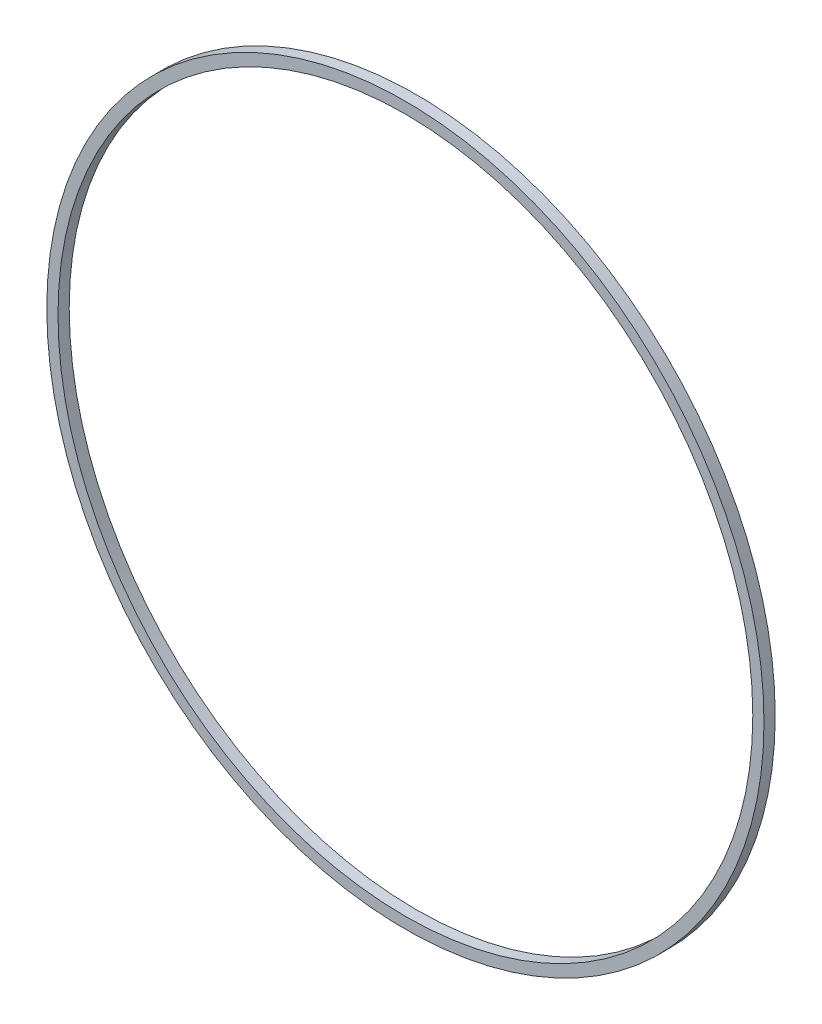
ISO-10303-21;
HEADER;
FILE_DESCRIPTION(('STEP AP214'),'2;1');
FILE_NAME('part.step','',(''),(''),'','','');
FILE_SCHEMA(('AUTOMOTIVE_DESIGN { 1 0 10303 214 1 1 1 1 }'));
ENDSEC;
DATA;
#1=APPLICATION_CONTEXT('core data for automotive mechanical design processes');
#2=APPLICATION_PROTOCOL_DEFINITION('international standard','automotive_design',2000,#1);
#3=PRODUCT_CONTEXT('',#1,'mechanical');
#4=PRODUCT('Part','Part','',(#3));
#5=PRODUCT_RELATED_PRODUCT_CATEGORY('part','',(#4));
#6=PRODUCT_DEFINITION_FORMATION('','',#4);
#7=PRODUCT_DEFINITION_CONTEXT('part definition',#1,'design');
#8=PRODUCT_DEFINITION('design','',#6,#7);
#9=PRODUCT_DEFINITION_SHAPE('','',#8);
#10=(LENGTH_UNIT() NAMED_UNIT(*) SI_UNIT(.MILLI.,.METRE.));
#11=(NAMED_UNIT(*) PLANE_ANGLE_UNIT() SI_UNIT($,.RADIAN.));
#12=(NAMED_UNIT(*) SI_UNIT($,.STERADIAN.) SOLID_ANGLE_UNIT());
#13=UNCERTAINTY_MEASURE_WITH_UNIT(LENGTH_MEASURE(1.E-05),#10,'distance_accuracy_value','');
#14=(GEOMETRIC_REPRESENTATION_CONTEXT(3) GLOBAL_UNCERTAINTY_ASSIGNED_CONTEXT((#13)) GLOBAL_UNIT_ASSIGNED_CONTEXT((#10,
#11,#12)) REPRESENTATION_CONTEXT('',''));
#15=CARTESIAN_POINT('',(0.,0.,0.));
#16=DIRECTION('',(0.,0.,1.));
#17=DIRECTION('',(1.,0.,0.));
#18=AXIS2_PLACEMENT_3D('',#15,#16,#17);
#19=CARTESIAN_POINT('',(0.,0.,0.5));
#20=DIRECTION('',(0.,0.,1.));
#21=DIRECTION('',(1.,0.,0.));
#22=AXIS2_PLACEMENT_3D('',#19,#20,#21);
#23=PLANE('',#22);
#24=CARTESIAN_POINT('',(0.,0.,0.5));
#25=DIRECTION('',(0.,0.,1.));
#26=DIRECTION('',(1.,0.,0.));
#27=AXIS2_PLACEMENT_3D('',#24,#25,#26);
#28=CIRCLE('',#27,16.);
#29=CARTESIAN_POINT('',(16.,0.,0.5));
#30=VERTEX_POINT('',#29);
#31=EDGE_CURVE('E10',#30,#30,#28,.T.);
#32=ORIENTED_EDGE('',*,*,#31,.T.);
#33=EDGE_LOOP('',(#32));
#34=FACE_BOUND('',#33,.T.);
#35=CARTESIAN_POINT('',(0.,0.,0.5));
#36=DIRECTION('',(0.,0.,1.));
#37=DIRECTION('',(1.,0.,0.));
#38=AXIS2_PLACEMENT_3D('',#35,#36,#37);
#39=CIRCLE('',#38,15.5);
#40=CARTESIAN_POINT('',(15.5,0.,0.5));
#41=VERTEX_POINT('',#40);
#42=EDGE_CURVE('E50',#41,#41,#39,.T.);
#43=ORIENTED_EDGE('',*,*,#42,.F.);
#44=EDGE_LOOP('',(#43));
#45=FACE_BOUND('',#44,.T.);
#46=ADVANCED_FACE('F37',(#34,#45),#23,.T.);
#47=CARTESIAN_POINT('',(0.,0.,0.));
#48=DIRECTION('',(0.,0.,1.));
#49=DIRECTION('',(1.,0.,0.));
#50=AXIS2_PLACEMENT_3D('',#47,#48,#49);
#51=PLANE('',#50);
#52=CARTESIAN_POINT('',(0.,0.,0.));
#53=DIRECTION('',(0.,0.,1.));
#54=DIRECTION('',(1.,0.,0.));
#55=AXIS2_PLACEMENT_3D('',#52,#53,#54);
#56=CIRCLE('',#55,16.);
#57=CARTESIAN_POINT('',(16.,0.,0.));
#58=VERTEX_POINT('',#57);
#59=EDGE_CURVE('E41',#58,#58,#56,.T.);
#60=ORIENTED_EDGE('',*,*,#59,.F.);
#61=EDGE_LOOP('',(#60));
#62=FACE_BOUND('',#61,.T.);
#63=CARTESIAN_POINT('',(0.,0.,0.));
#64=DIRECTION('',(0.,0.,1.));
#65=DIRECTION('',(1.,0.,0.));
#66=AXIS2_PLACEMENT_3D('',#63,#64,#65);
#67=CIRCLE('',#66,15.5);
#68=CARTESIAN_POINT('',(15.5,0.,0.));
#69=VERTEX_POINT('',#68);
#70=EDGE_CURVE('E52',#69,#69,#67,.T.);
#71=ORIENTED_EDGE('',*,*,#70,.T.);
#72=EDGE_LOOP('',(#71));
#73=FACE_BOUND('',#72,.T.);
#74=ADVANCED_FACE('F64',(#62,#73),#51,.F.);
#75=CARTESIAN_POINT('',(0.,0.,0.5));
#76=DIRECTION('',(0.,0.,-1.));
#77=DIRECTION('',(-1.,0.,0.));
#78=AXIS2_PLACEMENT_3D('',#75,#76,#77);
#79=CYLINDRICAL_SURFACE('',#78,16.);
#80=ORIENTED_EDGE('',*,*,#31,.F.);
#81=EDGE_LOOP('',(#80));
#82=FACE_BOUND('',#81,.T.);
#83=ORIENTED_EDGE('',*,*,#59,.T.);
#84=EDGE_LOOP('',(#83));
#85=FACE_BOUND('',#84,.T.);
#86=ADVANCED_FACE('F39',(#82,#85),#79,.T.);
#87=CARTESIAN_POINT('',(0.,0.,0.5));
#88=DIRECTION('',(0.,0.,-1.));
#89=DIRECTION('',(-1.,0.,0.));
#90=AXIS2_PLACEMENT_3D('',#87,#88,#89);
#91=CYLINDRICAL_SURFACE('',#90,15.5);
#92=ORIENTED_EDGE('',*,*,#42,.T.);
#93=EDGE_LOOP('',(#92));
#94=FACE_BOUND('',#93,.T.);
#95=ORIENTED_EDGE('',*,*,#70,.F.);
#96=EDGE_LOOP('',(#95));
#97=FACE_BOUND('',#96,.T.);
#98=ADVANCED_FACE('F60',(#94,#97),#91,.F.);
#99=CLOSED_SHELL('',(#46,#74,#86,#98));
#100=MANIFOLD_SOLID_BREP('B2',#99);
#101=ADVANCED_BREP_SHAPE_REPRESENTATION('',(#18,#100),#14);
#102=SHAPE_DEFINITION_REPRESENTATION(#9,#101);
ENDSEC;
END-ISO-10303-21;
